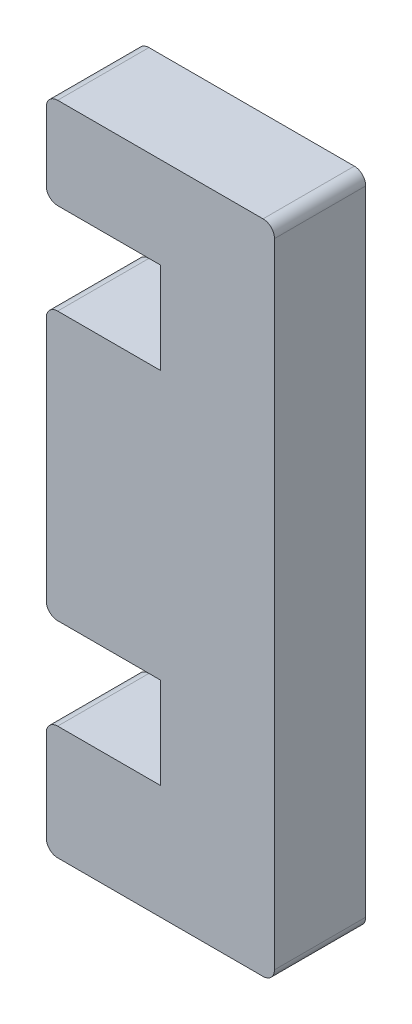
ISO-10303-21;
HEADER;
FILE_DESCRIPTION(('STEP AP214'),'2;1');
FILE_NAME('part.step','',(''),(''),'','','');
FILE_SCHEMA(('AUTOMOTIVE_DESIGN { 1 0 10303 214 1 1 1 1 }'));
ENDSEC;
DATA;
#1=APPLICATION_CONTEXT('core data for automotive mechanical design processes');
#2=APPLICATION_PROTOCOL_DEFINITION('international standard','automotive_design',2000,#1);
#3=PRODUCT_CONTEXT('',#1,'mechanical');
#4=PRODUCT('Part','Part','',(#3));
#5=PRODUCT_RELATED_PRODUCT_CATEGORY('part','',(#4));
#6=PRODUCT_DEFINITION_FORMATION('','',#4);
#7=PRODUCT_DEFINITION_CONTEXT('part definition',#1,'design');
#8=PRODUCT_DEFINITION('design','',#6,#7);
#9=PRODUCT_DEFINITION_SHAPE('','',#8);
#10=(LENGTH_UNIT() NAMED_UNIT(*) SI_UNIT(.MILLI.,.METRE.));
#11=(NAMED_UNIT(*) PLANE_ANGLE_UNIT() SI_UNIT($,.RADIAN.));
#12=(NAMED_UNIT(*) SI_UNIT($,.STERADIAN.) SOLID_ANGLE_UNIT());
#13=UNCERTAINTY_MEASURE_WITH_UNIT(LENGTH_MEASURE(1.E-05),#10,'distance_accuracy_value','');
#14=(GEOMETRIC_REPRESENTATION_CONTEXT(3) GLOBAL_UNCERTAINTY_ASSIGNED_CONTEXT((#13)) GLOBAL_UNIT_ASSIGNED_CONTEXT((#10,
#11,#12)) REPRESENTATION_CONTEXT('',''));
#15=CARTESIAN_POINT('',(0.,0.,0.));
#16=DIRECTION('',(0.,0.,1.));
#17=DIRECTION('',(1.,0.,0.));
#18=AXIS2_PLACEMENT_3D('',#15,#16,#17);
#19=CARTESIAN_POINT('',(10.,18.,8.));
#20=DIRECTION('',(1.,0.,0.));
#21=DIRECTION('',(0.,0.,-1.));
#22=AXIS2_PLACEMENT_3D('',#19,#20,#21);
#23=PLANE('',#22);
#24=DIRECTION('',(0.,-1.,0.));
#25=VECTOR('',#24,1.);
#26=CARTESIAN_POINT('',(10.,18.,0.));
#27=LINE('',#26,#25);
#28=CARTESIAN_POINT('',(10.,18.,0.));
#29=VERTEX_POINT('',#28);
#30=CARTESIAN_POINT('',(10.,10.,0.));
#31=VERTEX_POINT('',#30);
#32=EDGE_CURVE('E203',#29,#31,#27,.T.);
#33=ORIENTED_EDGE('',*,*,#32,.T.);
#34=DIRECTION('',(0.,0.,-1.));
#35=VECTOR('',#34,1.);
#36=CARTESIAN_POINT('',(10.,10.,8.));
#37=LINE('',#36,#35);
#38=CARTESIAN_POINT('',(10.,10.,8.));
#39=VERTEX_POINT('',#38);
#40=EDGE_CURVE('E11',#39,#31,#37,.T.);
#41=ORIENTED_EDGE('',*,*,#40,.F.);
#42=DIRECTION('',(0.,-1.,0.));
#43=VECTOR('',#42,1.);
#44=CARTESIAN_POINT('',(10.,18.,8.));
#45=LINE('',#44,#43);
#46=CARTESIAN_POINT('',(10.,18.,8.));
#47=VERTEX_POINT('',#46);
#48=EDGE_CURVE('E241',#47,#39,#45,.T.);
#49=ORIENTED_EDGE('',*,*,#48,.F.);
#50=DIRECTION('',(0.,0.,-1.));
#51=VECTOR('',#50,1.);
#52=CARTESIAN_POINT('',(10.,18.,8.));
#53=LINE('',#52,#51);
#54=EDGE_CURVE('E199',#47,#29,#53,.T.);
#55=ORIENTED_EDGE('',*,*,#54,.T.);
#56=EDGE_LOOP('',(#33,#41,#49,#55));
#57=FACE_BOUND('',#56,.T.);
#58=ADVANCED_FACE('F35',(#57),#23,.F.);
#59=CARTESIAN_POINT('',(10.,10.,8.));
#60=DIRECTION('',(0.,-1.,0.));
#61=DIRECTION('',(0.,0.,-1.));
#62=AXIS2_PLACEMENT_3D('',#59,#60,#61);
#63=PLANE('',#62);
#64=DIRECTION('',(-1.,0.,0.));
#65=VECTOR('',#64,1.);
#66=CARTESIAN_POINT('',(10.,10.,0.));
#67=LINE('',#66,#65);
#68=CARTESIAN_POINT('',(1.00000000000001,10.,0.));
#69=VERTEX_POINT('',#68);
#70=EDGE_CURVE('E206',#31,#69,#67,.T.);
#71=ORIENTED_EDGE('',*,*,#70,.T.);
#72=DIRECTION('',(0.,0.,-1.));
#73=VECTOR('',#72,1.);
#74=CARTESIAN_POINT('',(1.00000000000001,10.,8.));
#75=LINE('',#74,#73);
#76=CARTESIAN_POINT('',(1.00000000000001,10.,8.));
#77=VERTEX_POINT('',#76);
#78=EDGE_CURVE('E43',#77,#69,#75,.T.);
#79=ORIENTED_EDGE('',*,*,#78,.F.);
#80=DIRECTION('',(-1.,0.,0.));
#81=VECTOR('',#80,1.);
#82=CARTESIAN_POINT('',(10.,10.,8.));
#83=LINE('',#82,#81);
#84=EDGE_CURVE('E130',#39,#77,#83,.T.);
#85=ORIENTED_EDGE('',*,*,#84,.F.);
#86=ORIENTED_EDGE('',*,*,#40,.T.);
#87=EDGE_LOOP('',(#71,#79,#85,#86));
#88=FACE_BOUND('',#87,.T.);
#89=ADVANCED_FACE('F359',(#88),#63,.F.);
#90=CARTESIAN_POINT('',(1.,9.,8.));
#91=DIRECTION('',(0.,0.,-1.));
#92=DIRECTION('',(-1.,0.,0.));
#93=AXIS2_PLACEMENT_3D('',#90,#91,#92);
#94=CYLINDRICAL_SURFACE('',#93,1.);
#95=CARTESIAN_POINT('',(1.,9.,0.));
#96=DIRECTION('',(0.,0.,1.));
#97=DIRECTION('',(1.,0.,0.));
#98=AXIS2_PLACEMENT_3D('',#95,#96,#97);
#99=CIRCLE('',#98,1.);
#100=CARTESIAN_POINT('',(0.,9.,0.));
#101=VERTEX_POINT('',#100);
#102=EDGE_CURVE('E208',#69,#101,#99,.T.);
#103=ORIENTED_EDGE('',*,*,#102,.T.);
#104=DIRECTION('',(0.,0.,-1.));
#105=VECTOR('',#104,1.);
#106=CARTESIAN_POINT('',(0.,9.,8.));
#107=LINE('',#106,#105);
#108=CARTESIAN_POINT('',(0.,9.,8.));
#109=VERTEX_POINT('',#108);
#110=EDGE_CURVE('E284',#109,#101,#107,.T.);
#111=ORIENTED_EDGE('',*,*,#110,.F.);
#112=CARTESIAN_POINT('',(1.,9.,8.));
#113=DIRECTION('',(0.,0.,1.));
#114=DIRECTION('',(1.,0.,0.));
#115=AXIS2_PLACEMENT_3D('',#112,#113,#114);
#116=CIRCLE('',#115,1.);
#117=EDGE_CURVE('E292',#77,#109,#116,.T.);
#118=ORIENTED_EDGE('',*,*,#117,.F.);
#119=ORIENTED_EDGE('',*,*,#78,.T.);
#120=EDGE_LOOP('',(#103,#111,#118,#119));
#121=FACE_BOUND('',#120,.T.);
#122=ADVANCED_FACE('F290',(#121),#94,.T.);
#123=CARTESIAN_POINT('',(0.,9.,8.));
#124=DIRECTION('',(1.,0.,0.));
#125=DIRECTION('',(0.,1.,0.));
#126=AXIS2_PLACEMENT_3D('',#123,#124,#125);
#127=PLANE('',#126);
#128=DIRECTION('',(0.,-1.,0.));
#129=VECTOR('',#128,1.);
#130=CARTESIAN_POINT('',(0.,9.,0.));
#131=LINE('',#130,#129);
#132=CARTESIAN_POINT('',(0.,1.00000000000001,0.));
#133=VERTEX_POINT('',#132);
#134=EDGE_CURVE('E210',#101,#133,#131,.T.);
#135=ORIENTED_EDGE('',*,*,#134,.T.);
#136=DIRECTION('',(0.,0.,-1.));
#137=VECTOR('',#136,1.);
#138=CARTESIAN_POINT('',(0.,1.00000000000001,8.));
#139=LINE('',#138,#137);
#140=CARTESIAN_POINT('',(0.,1.00000000000001,8.));
#141=VERTEX_POINT('',#140);
#142=EDGE_CURVE('E281',#141,#133,#139,.T.);
#143=ORIENTED_EDGE('',*,*,#142,.F.);
#144=DIRECTION('',(0.,-1.,0.));
#145=VECTOR('',#144,1.);
#146=CARTESIAN_POINT('',(0.,9.,8.));
#147=LINE('',#146,#145);
#148=EDGE_CURVE('E310',#109,#141,#147,.T.);
#149=ORIENTED_EDGE('',*,*,#148,.F.);
#150=ORIENTED_EDGE('',*,*,#110,.T.);
#151=EDGE_LOOP('',(#135,#143,#149,#150));
#152=FACE_BOUND('',#151,.T.);
#153=ADVANCED_FACE('F301',(#152),#127,.F.);
#154=CARTESIAN_POINT('',(1.,1.,8.));
#155=DIRECTION('',(0.,0.,-1.));
#156=DIRECTION('',(-1.,0.,0.));
#157=AXIS2_PLACEMENT_3D('',#154,#155,#156);
#158=CYLINDRICAL_SURFACE('',#157,1.);
#159=CARTESIAN_POINT('',(1.,1.,0.));
#160=DIRECTION('',(0.,0.,1.));
#161=DIRECTION('',(1.,0.,0.));
#162=AXIS2_PLACEMENT_3D('',#159,#160,#161);
#163=CIRCLE('',#162,1.);
#164=CARTESIAN_POINT('',(1.00000000000001,0.,0.));
#165=VERTEX_POINT('',#164);
#166=EDGE_CURVE('E212',#133,#165,#163,.T.);
#167=ORIENTED_EDGE('',*,*,#166,.T.);
#168=DIRECTION('',(0.,0.,-1.));
#169=VECTOR('',#168,1.);
#170=CARTESIAN_POINT('',(1.00000000000001,0.,8.));
#171=LINE('',#170,#169);
#172=CARTESIAN_POINT('',(1.00000000000001,0.,8.));
#173=VERTEX_POINT('',#172);
#174=EDGE_CURVE('E278',#173,#165,#171,.T.);
#175=ORIENTED_EDGE('',*,*,#174,.F.);
#176=CARTESIAN_POINT('',(1.,1.,8.));
#177=DIRECTION('',(0.,0.,1.));
#178=DIRECTION('',(1.,0.,0.));
#179=AXIS2_PLACEMENT_3D('',#176,#177,#178);
#180=CIRCLE('',#179,1.);
#181=EDGE_CURVE('E307',#141,#173,#180,.T.);
#182=ORIENTED_EDGE('',*,*,#181,.F.);
#183=ORIENTED_EDGE('',*,*,#142,.T.);
#184=EDGE_LOOP('',(#167,#175,#182,#183));
#185=FACE_BOUND('',#184,.T.);
#186=ADVANCED_FACE('F305',(#185),#158,.T.);
#187=CARTESIAN_POINT('',(1.00000000000001,0.,8.));
#188=DIRECTION('',(0.,1.,0.));
#189=DIRECTION('',(0.,0.,1.));
#190=AXIS2_PLACEMENT_3D('',#187,#188,#189);
#191=PLANE('',#190);
#192=DIRECTION('',(1.,0.,0.));
#193=VECTOR('',#192,1.);
#194=CARTESIAN_POINT('',(1.00000000000001,0.,0.));
#195=LINE('',#194,#193);
#196=CARTESIAN_POINT('',(19.,0.,0.));
#197=VERTEX_POINT('',#196);
#198=EDGE_CURVE('E214',#165,#197,#195,.T.);
#199=ORIENTED_EDGE('',*,*,#198,.T.);
#200=DIRECTION('',(0.,0.,-1.));
#201=VECTOR('',#200,1.);
#202=CARTESIAN_POINT('',(19.,0.,8.));
#203=LINE('',#202,#201);
#204=CARTESIAN_POINT('',(19.,0.,8.));
#205=VERTEX_POINT('',#204);
#206=EDGE_CURVE('E275',#205,#197,#203,.T.);
#207=ORIENTED_EDGE('',*,*,#206,.F.);
#208=DIRECTION('',(1.,0.,0.));
#209=VECTOR('',#208,1.);
#210=CARTESIAN_POINT('',(1.00000000000001,0.,8.));
#211=LINE('',#210,#209);
#212=EDGE_CURVE('E309',#173,#205,#211,.T.);
#213=ORIENTED_EDGE('',*,*,#212,.F.);
#214=ORIENTED_EDGE('',*,*,#174,.T.);
#215=EDGE_LOOP('',(#199,#207,#213,#214));
#216=FACE_BOUND('',#215,.T.);
#217=ADVANCED_FACE('F372',(#216),#191,.F.);
#218=CARTESIAN_POINT('',(19.,1.,8.));
#219=DIRECTION('',(0.,0.,-1.));
#220=DIRECTION('',(-1.,0.,0.));
#221=AXIS2_PLACEMENT_3D('',#218,#219,#220);
#222=CYLINDRICAL_SURFACE('',#221,1.);
#223=CARTESIAN_POINT('',(19.,1.,0.));
#224=DIRECTION('',(0.,0.,1.));
#225=DIRECTION('',(1.,0.,0.));
#226=AXIS2_PLACEMENT_3D('',#223,#224,#225);
#227=CIRCLE('',#226,1.);
#228=CARTESIAN_POINT('',(20.,1.00000000000001,0.));
#229=VERTEX_POINT('',#228);
#230=EDGE_CURVE('E216',#197,#229,#227,.T.);
#231=ORIENTED_EDGE('',*,*,#230,.T.);
#232=DIRECTION('',(0.,0.,-1.));
#233=VECTOR('',#232,1.);
#234=CARTESIAN_POINT('',(20.,1.00000000000001,8.));
#235=LINE('',#234,#233);
#236=CARTESIAN_POINT('',(20.,1.00000000000001,8.));
#237=VERTEX_POINT('',#236);
#238=EDGE_CURVE('E272',#237,#229,#235,.T.);
#239=ORIENTED_EDGE('',*,*,#238,.F.);
#240=CARTESIAN_POINT('',(19.,1.,8.));
#241=DIRECTION('',(0.,0.,1.));
#242=DIRECTION('',(1.,0.,0.));
#243=AXIS2_PLACEMENT_3D('',#240,#241,#242);
#244=CIRCLE('',#243,1.);
#245=EDGE_CURVE('E312',#205,#237,#244,.T.);
#246=ORIENTED_EDGE('',*,*,#245,.F.);
#247=ORIENTED_EDGE('',*,*,#206,.T.);
#248=EDGE_LOOP('',(#231,#239,#246,#247));
#249=FACE_BOUND('',#248,.T.);
#250=ADVANCED_FACE('F375',(#249),#222,.T.);
#251=CARTESIAN_POINT('',(20.,1.00000000000001,8.));
#252=DIRECTION('',(-1.,0.,0.));
#253=DIRECTION('',(0.,0.,1.));
#254=AXIS2_PLACEMENT_3D('',#251,#252,#253);
#255=PLANE('',#254);
#256=DIRECTION('',(0.,1.,0.));
#257=VECTOR('',#256,1.);
#258=CARTESIAN_POINT('',(20.,1.00000000000001,0.));
#259=LINE('',#258,#257);
#260=CARTESIAN_POINT('',(20.,56.5,0.));
#261=VERTEX_POINT('',#260);
#262=EDGE_CURVE('E218',#229,#261,#259,.T.);
#263=ORIENTED_EDGE('',*,*,#262,.T.);
#264=DIRECTION('',(0.,0.,-1.));
#265=VECTOR('',#264,1.);
#266=CARTESIAN_POINT('',(20.,56.5,8.));
#267=LINE('',#266,#265);
#268=CARTESIAN_POINT('',(20.,56.5,8.));
#269=VERTEX_POINT('',#268);
#270=EDGE_CURVE('E269',#269,#261,#267,.T.);
#271=ORIENTED_EDGE('',*,*,#270,.F.);
#272=DIRECTION('',(0.,1.,0.));
#273=VECTOR('',#272,1.);
#274=CARTESIAN_POINT('',(20.,1.00000000000001,8.));
#275=LINE('',#274,#273);
#276=EDGE_CURVE('E318',#237,#269,#275,.T.);
#277=ORIENTED_EDGE('',*,*,#276,.F.);
#278=ORIENTED_EDGE('',*,*,#238,.T.);
#279=EDGE_LOOP('',(#263,#271,#277,#278));
#280=FACE_BOUND('',#279,.T.);
#281=ADVANCED_FACE('F379',(#280),#255,.F.);
#282=CARTESIAN_POINT('',(19.,56.5,8.));
#283=DIRECTION('',(0.,0.,-1.));
#284=DIRECTION('',(-1.,0.,0.));
#285=AXIS2_PLACEMENT_3D('',#282,#283,#284);
#286=CYLINDRICAL_SURFACE('',#285,1.);
#287=CARTESIAN_POINT('',(19.,56.5,0.));
#288=DIRECTION('',(0.,0.,1.));
#289=DIRECTION('',(1.,0.,0.));
#290=AXIS2_PLACEMENT_3D('',#287,#288,#289);
#291=CIRCLE('',#290,1.);
#292=CARTESIAN_POINT('',(19.,57.5,0.));
#293=VERTEX_POINT('',#292);
#294=EDGE_CURVE('E220',#261,#293,#291,.T.);
#295=ORIENTED_EDGE('',*,*,#294,.T.);
#296=DIRECTION('',(0.,0.,-1.));
#297=VECTOR('',#296,1.);
#298=CARTESIAN_POINT('',(19.,57.5,8.));
#299=LINE('',#298,#297);
#300=CARTESIAN_POINT('',(19.,57.5,8.));
#301=VERTEX_POINT('',#300);
#302=EDGE_CURVE('E266',#301,#293,#299,.T.);
#303=ORIENTED_EDGE('',*,*,#302,.F.);
#304=CARTESIAN_POINT('',(19.,56.5,8.));
#305=DIRECTION('',(0.,0.,1.));
#306=DIRECTION('',(1.,0.,0.));
#307=AXIS2_PLACEMENT_3D('',#304,#305,#306);
#308=CIRCLE('',#307,1.);
#309=EDGE_CURVE('E320',#269,#301,#308,.T.);
#310=ORIENTED_EDGE('',*,*,#309,.F.);
#311=ORIENTED_EDGE('',*,*,#270,.T.);
#312=EDGE_LOOP('',(#295,#303,#310,#311));
#313=FACE_BOUND('',#312,.T.);
#314=ADVANCED_FACE('F383',(#313),#286,.T.);
#315=CARTESIAN_POINT('',(19.,57.5,8.));
#316=DIRECTION('',(0.,-1.,0.));
#317=DIRECTION('',(1.,0.,0.));
#318=AXIS2_PLACEMENT_3D('',#315,#316,#317);
#319=PLANE('',#318);
#320=DIRECTION('',(-1.,0.,0.));
#321=VECTOR('',#320,1.);
#322=CARTESIAN_POINT('',(19.,57.5,0.));
#323=LINE('',#322,#321);
#324=CARTESIAN_POINT('',(1.,57.5,0.));
#325=VERTEX_POINT('',#324);
#326=EDGE_CURVE('E222',#293,#325,#323,.T.);
#327=ORIENTED_EDGE('',*,*,#326,.T.);
#328=DIRECTION('',(0.,0.,-1.));
#329=VECTOR('',#328,1.);
#330=CARTESIAN_POINT('',(1.,57.5,8.));
#331=LINE('',#330,#329);
#332=CARTESIAN_POINT('',(1.,57.5,8.));
#333=VERTEX_POINT('',#332);
#334=EDGE_CURVE('E263',#333,#325,#331,.T.);
#335=ORIENTED_EDGE('',*,*,#334,.F.);
#336=DIRECTION('',(-1.,0.,0.));
#337=VECTOR('',#336,1.);
#338=CARTESIAN_POINT('',(19.,57.5,8.));
#339=LINE('',#338,#337);
#340=EDGE_CURVE('E322',#301,#333,#339,.T.);
#341=ORIENTED_EDGE('',*,*,#340,.F.);
#342=ORIENTED_EDGE('',*,*,#302,.T.);
#343=EDGE_LOOP('',(#327,#335,#341,#342));
#344=FACE_BOUND('',#343,.T.);
#345=ADVANCED_FACE('F387',(#344),#319,.F.);
#346=CARTESIAN_POINT('',(1.,56.5,8.));
#347=DIRECTION('',(0.,0.,-1.));
#348=DIRECTION('',(-1.,0.,0.));
#349=AXIS2_PLACEMENT_3D('',#346,#347,#348);
#350=CYLINDRICAL_SURFACE('',#349,0.999999999999997);
#351=CARTESIAN_POINT('',(1.,56.5,0.));
#352=DIRECTION('',(0.,0.,1.));
#353=DIRECTION('',(1.,0.,0.));
#354=AXIS2_PLACEMENT_3D('',#351,#352,#353);
#355=CIRCLE('',#354,0.999999999999997);
#356=CARTESIAN_POINT('',(0.,56.5,0.));
#357=VERTEX_POINT('',#356);
#358=EDGE_CURVE('E224',#325,#357,#355,.T.);
#359=ORIENTED_EDGE('',*,*,#358,.T.);
#360=DIRECTION('',(0.,0.,-1.));
#361=VECTOR('',#360,1.);
#362=CARTESIAN_POINT('',(0.,56.5,8.));
#363=LINE('',#362,#361);
#364=CARTESIAN_POINT('',(0.,56.5,8.));
#365=VERTEX_POINT('',#364);
#366=EDGE_CURVE('E260',#365,#357,#363,.T.);
#367=ORIENTED_EDGE('',*,*,#366,.F.);
#368=CARTESIAN_POINT('',(1.,56.5,8.));
#369=DIRECTION('',(0.,0.,1.));
#370=DIRECTION('',(1.,0.,0.));
#371=AXIS2_PLACEMENT_3D('',#368,#369,#370);
#372=CIRCLE('',#371,0.999999999999997);
#373=EDGE_CURVE('E324',#333,#365,#372,.T.);
#374=ORIENTED_EDGE('',*,*,#373,.F.);
#375=ORIENTED_EDGE('',*,*,#334,.T.);
#376=EDGE_LOOP('',(#359,#367,#374,#375));
#377=FACE_BOUND('',#376,.T.);
#378=ADVANCED_FACE('F391',(#377),#350,.T.);
#379=CARTESIAN_POINT('',(0.,56.5,8.));
#380=DIRECTION('',(1.,0.,0.));
#381=DIRECTION('',(0.,1.,0.));
#382=AXIS2_PLACEMENT_3D('',#379,#380,#381);
#383=PLANE('',#382);
#384=DIRECTION('',(0.,-1.,0.));
#385=VECTOR('',#384,1.);
#386=CARTESIAN_POINT('',(0.,56.5,0.));
#387=LINE('',#386,#385);
#388=CARTESIAN_POINT('',(0.,50.5,0.));
#389=VERTEX_POINT('',#388);
#390=EDGE_CURVE('E226',#357,#389,#387,.T.);
#391=ORIENTED_EDGE('',*,*,#390,.T.);
#392=DIRECTION('',(0.,0.,-1.));
#393=VECTOR('',#392,1.);
#394=CARTESIAN_POINT('',(0.,50.5,8.));
#395=LINE('',#394,#393);
#396=CARTESIAN_POINT('',(0.,50.5,8.));
#397=VERTEX_POINT('',#396);
#398=EDGE_CURVE('E257',#397,#389,#395,.T.);
#399=ORIENTED_EDGE('',*,*,#398,.F.);
#400=DIRECTION('',(0.,-1.,0.));
#401=VECTOR('',#400,1.);
#402=CARTESIAN_POINT('',(0.,56.5,8.));
#403=LINE('',#402,#401);
#404=EDGE_CURVE('E326',#365,#397,#403,.T.);
#405=ORIENTED_EDGE('',*,*,#404,.F.);
#406=ORIENTED_EDGE('',*,*,#366,.T.);
#407=EDGE_LOOP('',(#391,#399,#405,#406));
#408=FACE_BOUND('',#407,.T.);
#409=ADVANCED_FACE('F395',(#408),#383,.F.);
#410=CARTESIAN_POINT('',(0.999999999999996,50.5,8.));
#411=DIRECTION('',(0.,0.,-1.));
#412=DIRECTION('',(-1.,0.,0.));
#413=AXIS2_PLACEMENT_3D('',#410,#411,#412);
#414=CYLINDRICAL_SURFACE('',#413,1.);
#415=CARTESIAN_POINT('',(0.999999999999996,50.5,0.));
#416=DIRECTION('',(0.,0.,1.));
#417=DIRECTION('',(1.,0.,0.));
#418=AXIS2_PLACEMENT_3D('',#415,#416,#417);
#419=CIRCLE('',#418,1.);
#420=CARTESIAN_POINT('',(1.,49.5,0.));
#421=VERTEX_POINT('',#420);
#422=EDGE_CURVE('E228',#389,#421,#419,.T.);
#423=ORIENTED_EDGE('',*,*,#422,.T.);
#424=DIRECTION('',(0.,0.,-1.));
#425=VECTOR('',#424,1.);
#426=CARTESIAN_POINT('',(1.,49.5,8.));
#427=LINE('',#426,#425);
#428=CARTESIAN_POINT('',(1.,49.5,8.));
#429=VERTEX_POINT('',#428);
#430=EDGE_CURVE('E254',#429,#421,#427,.T.);
#431=ORIENTED_EDGE('',*,*,#430,.F.);
#432=CARTESIAN_POINT('',(0.999999999999996,50.5,8.));
#433=DIRECTION('',(0.,0.,1.));
#434=DIRECTION('',(1.,0.,0.));
#435=AXIS2_PLACEMENT_3D('',#432,#433,#434);
#436=CIRCLE('',#435,1.);
#437=EDGE_CURVE('E328',#397,#429,#436,.T.);
#438=ORIENTED_EDGE('',*,*,#437,.F.);
#439=ORIENTED_EDGE('',*,*,#398,.T.);
#440=EDGE_LOOP('',(#423,#431,#438,#439));
#441=FACE_BOUND('',#440,.T.);
#442=ADVANCED_FACE('F399',(#441),#414,.T.);
#443=CARTESIAN_POINT('',(1.,49.5,8.));
#444=DIRECTION('',(0.,1.,0.));
#445=DIRECTION('',(0.,0.,1.));
#446=AXIS2_PLACEMENT_3D('',#443,#444,#445);
#447=PLANE('',#446);
#448=DIRECTION('',(1.,0.,0.));
#449=VECTOR('',#448,1.);
#450=CARTESIAN_POINT('',(1.,49.5,0.));
#451=LINE('',#450,#449);
#452=CARTESIAN_POINT('',(9.99999999999999,49.5,0.));
#453=VERTEX_POINT('',#452);
#454=EDGE_CURVE('E230',#421,#453,#451,.T.);
#455=ORIENTED_EDGE('',*,*,#454,.T.);
#456=DIRECTION('',(0.,0.,-1.));
#457=VECTOR('',#456,1.);
#458=CARTESIAN_POINT('',(9.99999999999999,49.5,8.));
#459=LINE('',#458,#457);
#460=CARTESIAN_POINT('',(9.99999999999999,49.5,8.));
#461=VERTEX_POINT('',#460);
#462=EDGE_CURVE('E251',#461,#453,#459,.T.);
#463=ORIENTED_EDGE('',*,*,#462,.F.);
#464=DIRECTION('',(1.,0.,0.));
#465=VECTOR('',#464,1.);
#466=CARTESIAN_POINT('',(1.,49.5,8.));
#467=LINE('',#466,#465);
#468=EDGE_CURVE('E330',#429,#461,#467,.T.);
#469=ORIENTED_EDGE('',*,*,#468,.F.);
#470=ORIENTED_EDGE('',*,*,#430,.T.);
#471=EDGE_LOOP('',(#455,#463,#469,#470));
#472=FACE_BOUND('',#471,.T.);
#473=ADVANCED_FACE('F403',(#472),#447,.F.);
#474=CARTESIAN_POINT('',(9.99999999999999,49.5,8.));
#475=DIRECTION('',(1.,0.,0.));
#476=DIRECTION('',(0.,1.,0.));
#477=AXIS2_PLACEMENT_3D('',#474,#475,#476);
#478=PLANE('',#477);
#479=DIRECTION('',(0.,-1.,0.));
#480=VECTOR('',#479,1.);
#481=CARTESIAN_POINT('',(9.99999999999999,49.5,0.));
#482=LINE('',#481,#480);
#483=CARTESIAN_POINT('',(9.99999999999999,41.5,0.));
#484=VERTEX_POINT('',#483);
#485=EDGE_CURVE('E232',#453,#484,#482,.T.);
#486=ORIENTED_EDGE('',*,*,#485,.T.);
#487=DIRECTION('',(0.,0.,-1.));
#488=VECTOR('',#487,1.);
#489=CARTESIAN_POINT('',(9.99999999999999,41.5,8.));
#490=LINE('',#489,#488);
#491=CARTESIAN_POINT('',(9.99999999999999,41.5,8.));
#492=VERTEX_POINT('',#491);
#493=EDGE_CURVE('E248',#492,#484,#490,.T.);
#494=ORIENTED_EDGE('',*,*,#493,.F.);
#495=DIRECTION('',(0.,-1.,0.));
#496=VECTOR('',#495,1.);
#497=CARTESIAN_POINT('',(9.99999999999999,49.5,8.));
#498=LINE('',#497,#496);
#499=EDGE_CURVE('E332',#461,#492,#498,.T.);
#500=ORIENTED_EDGE('',*,*,#499,.F.);
#501=ORIENTED_EDGE('',*,*,#462,.T.);
#502=EDGE_LOOP('',(#486,#494,#500,#501));
#503=FACE_BOUND('',#502,.T.);
#504=ADVANCED_FACE('F407',(#503),#478,.F.);
#505=CARTESIAN_POINT('',(9.99999999999999,41.5,8.));
#506=DIRECTION('',(0.,-1.,0.));
#507=DIRECTION('',(0.,0.,-1.));
#508=AXIS2_PLACEMENT_3D('',#505,#506,#507);
#509=PLANE('',#508);
#510=DIRECTION('',(-1.,0.,0.));
#511=VECTOR('',#510,1.);
#512=CARTESIAN_POINT('',(9.99999999999999,41.5,0.));
#513=LINE('',#512,#511);
#514=CARTESIAN_POINT('',(1.00000000000001,41.5,0.));
#515=VERTEX_POINT('',#514);
#516=EDGE_CURVE('E234',#484,#515,#513,.T.);
#517=ORIENTED_EDGE('',*,*,#516,.T.);
#518=DIRECTION('',(0.,0.,-1.));
#519=VECTOR('',#518,1.);
#520=CARTESIAN_POINT('',(1.00000000000001,41.5,8.));
#521=LINE('',#520,#519);
#522=CARTESIAN_POINT('',(1.00000000000001,41.5,8.));
#523=VERTEX_POINT('',#522);
#524=EDGE_CURVE('E245',#523,#515,#521,.T.);
#525=ORIENTED_EDGE('',*,*,#524,.F.);
#526=DIRECTION('',(-1.,0.,0.));
#527=VECTOR('',#526,1.);
#528=CARTESIAN_POINT('',(9.99999999999999,41.5,8.));
#529=LINE('',#528,#527);
#530=EDGE_CURVE('E334',#492,#523,#529,.T.);
#531=ORIENTED_EDGE('',*,*,#530,.F.);
#532=ORIENTED_EDGE('',*,*,#493,.T.);
#533=EDGE_LOOP('',(#517,#525,#531,#532));
#534=FACE_BOUND('',#533,.T.);
#535=ADVANCED_FACE('F340',(#534),#509,.F.);
#536=CARTESIAN_POINT('',(0.999999999999999,40.5,8.));
#537=DIRECTION('',(0.,0.,-1.));
#538=DIRECTION('',(-1.,0.,0.));
#539=AXIS2_PLACEMENT_3D('',#536,#537,#538);
#540=CYLINDRICAL_SURFACE('',#539,1.);
#541=CARTESIAN_POINT('',(0.999999999999999,40.5,0.));
#542=DIRECTION('',(0.,0.,1.));
#543=DIRECTION('',(-1.,0.,0.));
#544=AXIS2_PLACEMENT_3D('',#541,#542,#543);
#545=CIRCLE('',#544,1.);
#546=CARTESIAN_POINT('',(0.,40.5,0.));
#547=VERTEX_POINT('',#546);
#548=EDGE_CURVE('E236',#515,#547,#545,.T.);
#549=ORIENTED_EDGE('',*,*,#548,.T.);
#550=DIRECTION('',(0.,0.,-1.));
#551=VECTOR('',#550,1.);
#552=CARTESIAN_POINT('',(0.,40.5,8.));
#553=LINE('',#552,#551);
#554=CARTESIAN_POINT('',(0.,40.5,8.));
#555=VERTEX_POINT('',#554);
#556=EDGE_CURVE('E194',#555,#547,#553,.T.);
#557=ORIENTED_EDGE('',*,*,#556,.F.);
#558=CARTESIAN_POINT('',(0.999999999999999,40.5,8.));
#559=DIRECTION('',(0.,0.,1.));
#560=DIRECTION('',(-1.,0.,0.));
#561=AXIS2_PLACEMENT_3D('',#558,#559,#560);
#562=CIRCLE('',#561,1.);
#563=EDGE_CURVE('E185',#523,#555,#562,.T.);
#564=ORIENTED_EDGE('',*,*,#563,.F.);
#565=ORIENTED_EDGE('',*,*,#524,.T.);
#566=EDGE_LOOP('',(#549,#557,#564,#565));
#567=FACE_BOUND('',#566,.T.);
#568=ADVANCED_FACE('F344',(#567),#540,.T.);
#569=CARTESIAN_POINT('',(0.,40.5,8.));
#570=DIRECTION('',(1.,0.,0.));
#571=DIRECTION('',(0.,1.,0.));
#572=AXIS2_PLACEMENT_3D('',#569,#570,#571);
#573=PLANE('',#572);
#574=DIRECTION('',(0.,-1.,0.));
#575=VECTOR('',#574,1.);
#576=CARTESIAN_POINT('',(0.,40.5,0.));
#577=LINE('',#576,#575);
#578=CARTESIAN_POINT('',(0.,19.,0.));
#579=VERTEX_POINT('',#578);
#580=EDGE_CURVE('E193',#547,#579,#577,.T.);
#581=ORIENTED_EDGE('',*,*,#580,.T.);
#582=DIRECTION('',(0.,0.,-1.));
#583=VECTOR('',#582,1.);
#584=CARTESIAN_POINT('',(0.,19.,8.));
#585=LINE('',#584,#583);
#586=CARTESIAN_POINT('',(0.,19.,8.));
#587=VERTEX_POINT('',#586);
#588=EDGE_CURVE('E190',#587,#579,#585,.T.);
#589=ORIENTED_EDGE('',*,*,#588,.F.);
#590=DIRECTION('',(0.,-1.,0.));
#591=VECTOR('',#590,1.);
#592=CARTESIAN_POINT('',(0.,40.5,8.));
#593=LINE('',#592,#591);
#594=EDGE_CURVE('E179',#555,#587,#593,.T.);
#595=ORIENTED_EDGE('',*,*,#594,.F.);
#596=ORIENTED_EDGE('',*,*,#556,.T.);
#597=EDGE_LOOP('',(#581,#589,#595,#596));
#598=FACE_BOUND('',#597,.T.);
#599=ADVANCED_FACE('F191',(#598),#573,.F.);
#600=CARTESIAN_POINT('',(1.,19.,8.));
#601=DIRECTION('',(0.,0.,-1.));
#602=DIRECTION('',(-1.,0.,0.));
#603=AXIS2_PLACEMENT_3D('',#600,#601,#602);
#604=CYLINDRICAL_SURFACE('',#603,1.);
#605=CARTESIAN_POINT('',(1.,19.,0.));
#606=DIRECTION('',(0.,0.,1.));
#607=DIRECTION('',(-1.,0.,0.));
#608=AXIS2_PLACEMENT_3D('',#605,#606,#607);
#609=CIRCLE('',#608,1.);
#610=CARTESIAN_POINT('',(1.00000000000001,18.,0.));
#611=VERTEX_POINT('',#610);
#612=EDGE_CURVE('E116',#579,#611,#609,.T.);
#613=ORIENTED_EDGE('',*,*,#612,.T.);
#614=DIRECTION('',(0.,0.,-1.));
#615=VECTOR('',#614,1.);
#616=CARTESIAN_POINT('',(1.00000000000001,18.,8.));
#617=LINE('',#616,#615);
#618=CARTESIAN_POINT('',(1.00000000000001,18.,8.));
#619=VERTEX_POINT('',#618);
#620=EDGE_CURVE('E195',#619,#611,#617,.T.);
#621=ORIENTED_EDGE('',*,*,#620,.F.);
#622=CARTESIAN_POINT('',(1.,19.,8.));
#623=DIRECTION('',(0.,0.,1.));
#624=DIRECTION('',(-1.,0.,0.));
#625=AXIS2_PLACEMENT_3D('',#622,#623,#624);
#626=CIRCLE('',#625,1.);
#627=EDGE_CURVE('E183',#587,#619,#626,.T.);
#628=ORIENTED_EDGE('',*,*,#627,.F.);
#629=ORIENTED_EDGE('',*,*,#588,.T.);
#630=EDGE_LOOP('',(#613,#621,#628,#629));
#631=FACE_BOUND('',#630,.T.);
#632=ADVANCED_FACE('F197',(#631),#604,.T.);
#633=CARTESIAN_POINT('',(1.00000000000001,18.,8.));
#634=DIRECTION('',(0.,1.,0.));
#635=DIRECTION('',(0.,0.,1.));
#636=AXIS2_PLACEMENT_3D('',#633,#634,#635);
#637=PLANE('',#636);
#638=DIRECTION('',(1.,0.,0.));
#639=VECTOR('',#638,1.);
#640=CARTESIAN_POINT('',(1.00000000000001,18.,0.));
#641=LINE('',#640,#639);
#642=EDGE_CURVE('E122',#611,#29,#641,.T.);
#643=ORIENTED_EDGE('',*,*,#642,.T.);
#644=ORIENTED_EDGE('',*,*,#54,.F.);
#645=DIRECTION('',(1.,0.,0.));
#646=VECTOR('',#645,1.);
#647=CARTESIAN_POINT('',(1.00000000000001,18.,8.));
#648=LINE('',#647,#646);
#649=EDGE_CURVE('E51',#619,#47,#648,.T.);
#650=ORIENTED_EDGE('',*,*,#649,.F.);
#651=ORIENTED_EDGE('',*,*,#620,.T.);
#652=EDGE_LOOP('',(#643,#644,#650,#651));
#653=FACE_BOUND('',#652,.T.);
#654=ADVANCED_FACE('F348',(#653),#637,.F.);
#655=CARTESIAN_POINT('',(1.,9.,8.));
#656=DIRECTION('',(0.,0.,1.));
#657=DIRECTION('',(1.,0.,0.));
#658=AXIS2_PLACEMENT_3D('',#655,#656,#657);
#659=PLANE('',#658);
#660=ORIENTED_EDGE('',*,*,#48,.T.);
#661=ORIENTED_EDGE('',*,*,#84,.T.);
#662=ORIENTED_EDGE('',*,*,#117,.T.);
#663=ORIENTED_EDGE('',*,*,#148,.T.);
#664=ORIENTED_EDGE('',*,*,#181,.T.);
#665=ORIENTED_EDGE('',*,*,#212,.T.);
#666=ORIENTED_EDGE('',*,*,#245,.T.);
#667=ORIENTED_EDGE('',*,*,#276,.T.);
#668=ORIENTED_EDGE('',*,*,#309,.T.);
#669=ORIENTED_EDGE('',*,*,#340,.T.);
#670=ORIENTED_EDGE('',*,*,#373,.T.);
#671=ORIENTED_EDGE('',*,*,#404,.T.);
#672=ORIENTED_EDGE('',*,*,#437,.T.);
#673=ORIENTED_EDGE('',*,*,#468,.T.);
#674=ORIENTED_EDGE('',*,*,#499,.T.);
#675=ORIENTED_EDGE('',*,*,#530,.T.);
#676=ORIENTED_EDGE('',*,*,#563,.T.);
#677=ORIENTED_EDGE('',*,*,#594,.T.);
#678=ORIENTED_EDGE('',*,*,#627,.T.);
#679=ORIENTED_EDGE('',*,*,#649,.T.);
#680=EDGE_LOOP('',(#660,#661,#662,#663,#664,#665,#666,#667,#668,#669,#670,#671,#672,#673,#674,
#675,#676,#677,#678,#679));
#681=FACE_BOUND('',#680,.T.);
#682=ADVANCED_FACE('F181',(#681),#659,.T.);
#683=CARTESIAN_POINT('',(1.,9.,0.));
#684=DIRECTION('',(0.,0.,1.));
#685=DIRECTION('',(1.,0.,0.));
#686=AXIS2_PLACEMENT_3D('',#683,#684,#685);
#687=PLANE('',#686);
#688=ORIENTED_EDGE('',*,*,#32,.F.);
#689=ORIENTED_EDGE('',*,*,#642,.F.);
#690=ORIENTED_EDGE('',*,*,#612,.F.);
#691=ORIENTED_EDGE('',*,*,#580,.F.);
#692=ORIENTED_EDGE('',*,*,#548,.F.);
#693=ORIENTED_EDGE('',*,*,#516,.F.);
#694=ORIENTED_EDGE('',*,*,#485,.F.);
#695=ORIENTED_EDGE('',*,*,#454,.F.);
#696=ORIENTED_EDGE('',*,*,#422,.F.);
#697=ORIENTED_EDGE('',*,*,#390,.F.);
#698=ORIENTED_EDGE('',*,*,#358,.F.);
#699=ORIENTED_EDGE('',*,*,#326,.F.);
#700=ORIENTED_EDGE('',*,*,#294,.F.);
#701=ORIENTED_EDGE('',*,*,#262,.F.);
#702=ORIENTED_EDGE('',*,*,#230,.F.);
#703=ORIENTED_EDGE('',*,*,#198,.F.);
#704=ORIENTED_EDGE('',*,*,#166,.F.);
#705=ORIENTED_EDGE('',*,*,#134,.F.);
#706=ORIENTED_EDGE('',*,*,#102,.F.);
#707=ORIENTED_EDGE('',*,*,#70,.F.);
#708=EDGE_LOOP('',(#688,#689,#690,#691,#692,#693,#694,#695,#696,#697,#698,#699,#700,#701,#702,
#703,#704,#705,#706,#707));
#709=FACE_BOUND('',#708,.T.);
#710=ADVANCED_FACE('F296',(#709),#687,.F.);
#711=CLOSED_SHELL('',(#58,#89,#122,#153,#186,#217,#250,#281,#314,#345,#378,#409,#442,#473,#504,
#535,#568,#599,#632,#654,#682,#710));
#712=MANIFOLD_SOLID_BREP('B2',#711);
#713=ADVANCED_BREP_SHAPE_REPRESENTATION('',(#18,#712),#14);
#714=SHAPE_DEFINITION_REPRESENTATION(#9,#713);
ENDSEC;
END-ISO-10303-21;
